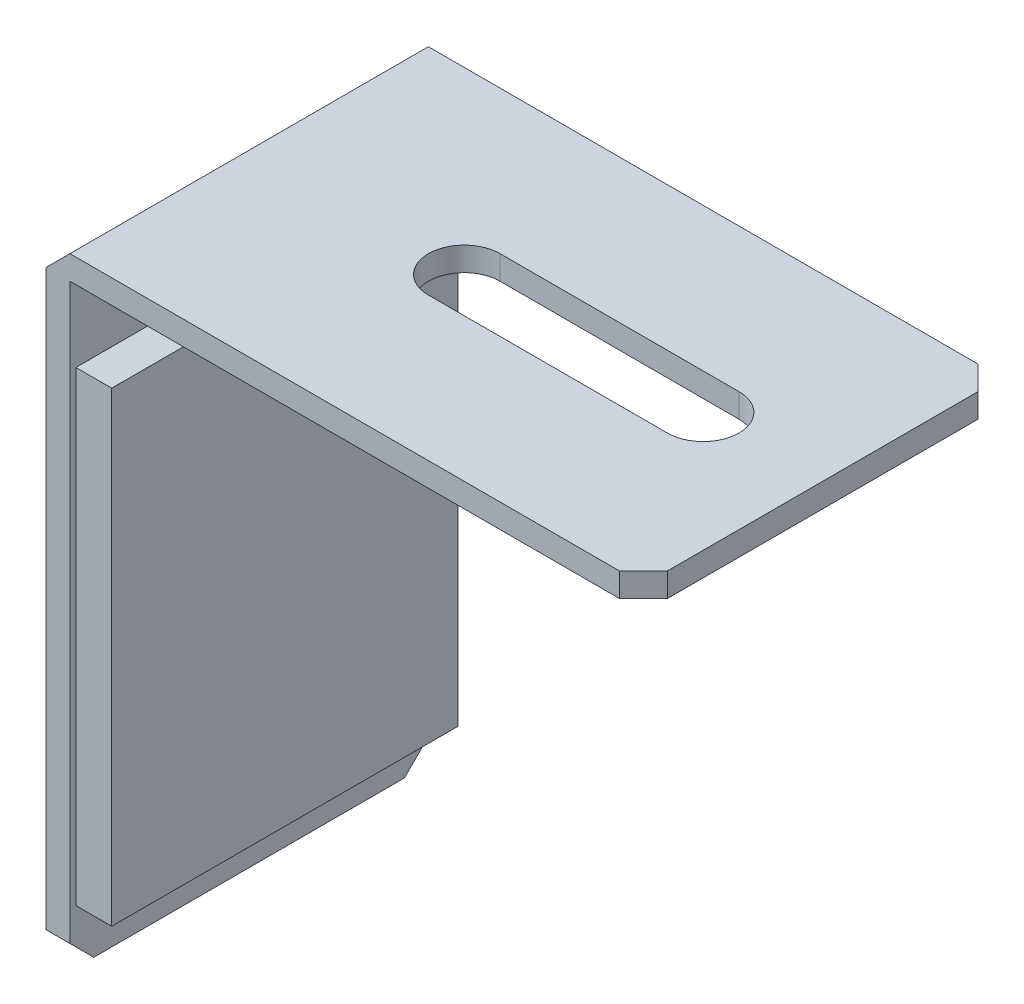
ISO-10303-21;
HEADER;
FILE_DESCRIPTION(('STEP AP214'),'2;1');
FILE_NAME('part.step','',(''),(''),'','','');
FILE_SCHEMA(('AUTOMOTIVE_DESIGN { 1 0 10303 214 1 1 1 1 }'));
ENDSEC;
DATA;
#1=APPLICATION_CONTEXT('core data for automotive mechanical design processes');
#2=APPLICATION_PROTOCOL_DEFINITION('international standard','automotive_design',2000,#1);
#3=PRODUCT_CONTEXT('',#1,'mechanical');
#4=PRODUCT('Part','Part','',(#3));
#5=PRODUCT_RELATED_PRODUCT_CATEGORY('part','',(#4));
#6=PRODUCT_DEFINITION_FORMATION('','',#4);
#7=PRODUCT_DEFINITION_CONTEXT('part definition',#1,'design');
#8=PRODUCT_DEFINITION('design','',#6,#7);
#9=PRODUCT_DEFINITION_SHAPE('','',#8);
#10=(LENGTH_UNIT() NAMED_UNIT(*) SI_UNIT(.MILLI.,.METRE.));
#11=(NAMED_UNIT(*) PLANE_ANGLE_UNIT() SI_UNIT($,.RADIAN.));
#12=(NAMED_UNIT(*) SI_UNIT($,.STERADIAN.) SOLID_ANGLE_UNIT());
#13=UNCERTAINTY_MEASURE_WITH_UNIT(LENGTH_MEASURE(1.E-05),#10,'distance_accuracy_value','');
#14=(GEOMETRIC_REPRESENTATION_CONTEXT(3) GLOBAL_UNCERTAINTY_ASSIGNED_CONTEXT((#13)) GLOBAL_UNIT_ASSIGNED_CONTEXT((#10,
#11,#12)) REPRESENTATION_CONTEXT('',''));
#15=CARTESIAN_POINT('',(0.,0.,0.));
#16=DIRECTION('',(0.,0.,1.));
#17=DIRECTION('',(1.,0.,0.));
#18=AXIS2_PLACEMENT_3D('',#15,#16,#17);
#19=CARTESIAN_POINT('',(2.,0.,30.));
#20=DIRECTION('',(-1.,0.,0.));
#21=DIRECTION('',(0.,0.,1.));
#22=AXIS2_PLACEMENT_3D('',#19,#20,#21);
#23=PLANE('',#22);
#24=DIRECTION('',(0.,0.,-1.));
#25=VECTOR('',#24,1.);
#26=CARTESIAN_POINT('',(2.,4.5,29.5));
#27=LINE('',#26,#25);
#28=CARTESIAN_POINT('',(2.,4.5,29.5));
#29=VERTEX_POINT('',#28);
#30=CARTESIAN_POINT('',(2.,4.5,0.5));
#31=VERTEX_POINT('',#30);
#32=EDGE_CURVE('E193',#29,#31,#27,.T.);
#33=ORIENTED_EDGE('',*,*,#32,.F.);
#34=DIRECTION('',(0.,1.,0.));
#35=VECTOR('',#34,1.);
#36=CARTESIAN_POINT('',(2.,4.5,29.5));
#37=LINE('',#36,#35);
#38=CARTESIAN_POINT('',(2.,43.5,29.5));
#39=VERTEX_POINT('',#38);
#40=EDGE_CURVE('E199',#29,#39,#37,.T.);
#41=ORIENTED_EDGE('',*,*,#40,.T.);
#42=DIRECTION('',(0.,0.,-1.));
#43=VECTOR('',#42,1.);
#44=CARTESIAN_POINT('',(2.,43.5,29.5));
#45=LINE('',#44,#43);
#46=CARTESIAN_POINT('',(2.,43.5,0.5));
#47=VERTEX_POINT('',#46);
#48=EDGE_CURVE('E175',#39,#47,#45,.T.);
#49=ORIENTED_EDGE('',*,*,#48,.T.);
#50=DIRECTION('',(0.,1.,0.));
#51=VECTOR('',#50,1.);
#52=CARTESIAN_POINT('',(2.,4.5,0.5));
#53=LINE('',#52,#51);
#54=EDGE_CURVE('E53',#31,#47,#53,.T.);
#55=ORIENTED_EDGE('',*,*,#54,.F.);
#56=EDGE_LOOP('',(#33,#41,#49,#55));
#57=FACE_BOUND('',#56,.T.);
#58=DIRECTION('',(0.,0.,-1.));
#59=VECTOR('',#58,1.);
#60=CARTESIAN_POINT('',(2.,0.,30.));
#61=LINE('',#60,#59);
#62=CARTESIAN_POINT('',(2.,0.,28.));
#63=VERTEX_POINT('',#62);
#64=CARTESIAN_POINT('',(2.,0.,2.00000000000001));
#65=VERTEX_POINT('',#64);
#66=EDGE_CURVE('E249',#63,#65,#61,.T.);
#67=ORIENTED_EDGE('',*,*,#66,.T.);
#68=DIRECTION('',(0.,-0.707106781186549,0.707106781186546));
#69=VECTOR('',#68,1.);
#70=CARTESIAN_POINT('',(2.,0.,2.00000000000001));
#71=LINE('',#70,#69);
#72=CARTESIAN_POINT('',(2.,2.00000000000002,0.));
#73=VERTEX_POINT('',#72);
#74=EDGE_CURVE('E307',#65,#73,#71,.F.);
#75=ORIENTED_EDGE('',*,*,#74,.T.);
#76=DIRECTION('',(0.,1.,0.));
#77=VECTOR('',#76,1.);
#78=CARTESIAN_POINT('',(2.,0.,0.));
#79=LINE('',#78,#77);
#80=CARTESIAN_POINT('',(2.,50.,0.));
#81=VERTEX_POINT('',#80);
#82=EDGE_CURVE('E236',#73,#81,#79,.T.);
#83=ORIENTED_EDGE('',*,*,#82,.T.);
#84=DIRECTION('',(0.,0.,-1.));
#85=VECTOR('',#84,1.);
#86=CARTESIAN_POINT('',(2.,50.,30.));
#87=LINE('',#86,#85);
#88=CARTESIAN_POINT('',(2.,50.,30.));
#89=VERTEX_POINT('',#88);
#90=EDGE_CURVE('E270',#89,#81,#87,.T.);
#91=ORIENTED_EDGE('',*,*,#90,.F.);
#92=DIRECTION('',(0.,1.,0.));
#93=VECTOR('',#92,1.);
#94=CARTESIAN_POINT('',(2.,0.,30.));
#95=LINE('',#94,#93);
#96=CARTESIAN_POINT('',(2.,2.00000000000001,30.));
#97=VERTEX_POINT('',#96);
#98=EDGE_CURVE('E237',#97,#89,#95,.T.);
#99=ORIENTED_EDGE('',*,*,#98,.F.);
#100=DIRECTION('',(0.,-0.707106781186546,-0.707106781186549));
#101=VECTOR('',#100,1.);
#102=CARTESIAN_POINT('',(2.,2.00000000000001,30.));
#103=LINE('',#102,#101);
#104=EDGE_CURVE('E305',#97,#63,#103,.T.);
#105=ORIENTED_EDGE('',*,*,#104,.T.);
#106=EDGE_LOOP('',(#67,#75,#83,#91,#99,#105));
#107=FACE_BOUND('',#106,.T.);
#108=ADVANCED_FACE('F38',(#57,#107),#23,.F.);
#109=CARTESIAN_POINT('',(0.,50.,30.));
#110=DIRECTION('',(0.,1.,0.));
#111=DIRECTION('',(0.,0.,1.));
#112=AXIS2_PLACEMENT_3D('',#109,#110,#111);
#113=PLANE('',#112);
#114=DIRECTION('',(1.,0.,0.));
#115=VECTOR('',#114,1.);
#116=CARTESIAN_POINT('',(0.,50.,12.));
#117=LINE('',#116,#115);
#118=CARTESIAN_POINT('',(20.,50.,12.));
#119=VERTEX_POINT('',#118);
#120=CARTESIAN_POINT('',(40.,50.,12.));
#121=VERTEX_POINT('',#120);
#122=EDGE_CURVE('E231',#119,#121,#117,.T.);
#123=ORIENTED_EDGE('',*,*,#122,.F.);
#124=CARTESIAN_POINT('',(20.,50.,15.));
#125=DIRECTION('',(0.,1.,0.));
#126=DIRECTION('',(0.,0.,1.));
#127=AXIS2_PLACEMENT_3D('',#124,#125,#126);
#128=CIRCLE('',#127,3.);
#129=CARTESIAN_POINT('',(20.,50.,18.));
#130=VERTEX_POINT('',#129);
#131=EDGE_CURVE('E233',#119,#130,#128,.T.);
#132=ORIENTED_EDGE('',*,*,#131,.T.);
#133=DIRECTION('',(1.,0.,0.));
#134=VECTOR('',#133,1.);
#135=CARTESIAN_POINT('',(0.,50.,18.));
#136=LINE('',#135,#134);
#137=CARTESIAN_POINT('',(40.,50.,18.));
#138=VERTEX_POINT('',#137);
#139=EDGE_CURVE('E220',#130,#138,#136,.T.);
#140=ORIENTED_EDGE('',*,*,#139,.T.);
#141=CARTESIAN_POINT('',(40.,50.,15.));
#142=DIRECTION('',(0.,1.,0.));
#143=DIRECTION('',(0.,0.,1.));
#144=AXIS2_PLACEMENT_3D('',#141,#142,#143);
#145=CIRCLE('',#144,3.);
#146=EDGE_CURVE('E228',#138,#121,#145,.T.);
#147=ORIENTED_EDGE('',*,*,#146,.T.);
#148=EDGE_LOOP('',(#123,#132,#140,#147));
#149=FACE_BOUND('',#148,.T.);
#150=DIRECTION('',(1.,0.,0.));
#151=VECTOR('',#150,1.);
#152=CARTESIAN_POINT('',(0.,50.,0.));
#153=LINE('',#152,#151);
#154=CARTESIAN_POINT('',(48.,50.,0.));
#155=VERTEX_POINT('',#154);
#156=EDGE_CURVE('E251',#81,#155,#153,.T.);
#157=ORIENTED_EDGE('',*,*,#156,.T.);
#158=DIRECTION('',(-0.707106781186549,0.,-0.707106781186546));
#159=VECTOR('',#158,1.);
#160=CARTESIAN_POINT('',(50.,50.,2.00000000000001));
#161=LINE('',#160,#159);
#162=CARTESIAN_POINT('',(50.,50.,2.00000000000001));
#163=VERTEX_POINT('',#162);
#164=EDGE_CURVE('E11',#155,#163,#161,.F.);
#165=ORIENTED_EDGE('',*,*,#164,.T.);
#166=DIRECTION('',(0.,0.,-1.));
#167=VECTOR('',#166,1.);
#168=CARTESIAN_POINT('',(50.,50.,30.));
#169=LINE('',#168,#167);
#170=CARTESIAN_POINT('',(50.,50.,28.));
#171=VERTEX_POINT('',#170);
#172=EDGE_CURVE('E267',#171,#163,#169,.T.);
#173=ORIENTED_EDGE('',*,*,#172,.F.);
#174=DIRECTION('',(-0.707106781186546,0.,0.707106781186549));
#175=VECTOR('',#174,1.);
#176=CARTESIAN_POINT('',(48.,50.,30.));
#177=LINE('',#176,#175);
#178=CARTESIAN_POINT('',(48.,50.,30.));
#179=VERTEX_POINT('',#178);
#180=EDGE_CURVE('E46',#171,#179,#177,.T.);
#181=ORIENTED_EDGE('',*,*,#180,.T.);
#182=DIRECTION('',(1.,0.,0.));
#183=VECTOR('',#182,1.);
#184=CARTESIAN_POINT('',(0.,50.,30.));
#185=LINE('',#184,#183);
#186=EDGE_CURVE('E239',#89,#179,#185,.T.);
#187=ORIENTED_EDGE('',*,*,#186,.F.);
#188=ORIENTED_EDGE('',*,*,#90,.T.);
#189=EDGE_LOOP('',(#157,#165,#173,#181,#187,#188));
#190=FACE_BOUND('',#189,.T.);
#191=ADVANCED_FACE('F317',(#149,#190),#113,.F.);
#192=CARTESIAN_POINT('',(50.,0.,30.));
#193=DIRECTION('',(-1.,0.,0.));
#194=DIRECTION('',(0.,0.,1.));
#195=AXIS2_PLACEMENT_3D('',#192,#193,#194);
#196=PLANE('',#195);
#197=ORIENTED_EDGE('',*,*,#172,.T.);
#198=DIRECTION('',(0.,1.,0.));
#199=VECTOR('',#198,1.);
#200=CARTESIAN_POINT('',(50.,0.,2.00000000000001));
#201=LINE('',#200,#199);
#202=CARTESIAN_POINT('',(50.,52.,2.00000000000001));
#203=VERTEX_POINT('',#202);
#204=EDGE_CURVE('E311',#163,#203,#201,.T.);
#205=ORIENTED_EDGE('',*,*,#204,.T.);
#206=DIRECTION('',(0.,0.,-1.));
#207=VECTOR('',#206,1.);
#208=CARTESIAN_POINT('',(50.,52.,30.));
#209=LINE('',#208,#207);
#210=CARTESIAN_POINT('',(50.,52.,28.));
#211=VERTEX_POINT('',#210);
#212=EDGE_CURVE('E264',#211,#203,#209,.T.);
#213=ORIENTED_EDGE('',*,*,#212,.F.);
#214=DIRECTION('',(0.,-1.,0.));
#215=VECTOR('',#214,1.);
#216=CARTESIAN_POINT('',(50.,50.,28.));
#217=LINE('',#216,#215);
#218=EDGE_CURVE('E309',#211,#171,#217,.T.);
#219=ORIENTED_EDGE('',*,*,#218,.T.);
#220=EDGE_LOOP('',(#197,#205,#213,#219));
#221=FACE_BOUND('',#220,.T.);
#222=ADVANCED_FACE('F331',(#221),#196,.F.);
#223=CARTESIAN_POINT('',(0.,52.,30.));
#224=DIRECTION('',(0.,1.,0.));
#225=DIRECTION('',(0.,0.,1.));
#226=AXIS2_PLACEMENT_3D('',#223,#224,#225);
#227=PLANE('',#226);
#228=CARTESIAN_POINT('',(20.,52.,15.));
#229=DIRECTION('',(0.,1.,0.));
#230=DIRECTION('',(0.,0.,1.));
#231=AXIS2_PLACEMENT_3D('',#228,#229,#230);
#232=CIRCLE('',#231,3.);
#233=CARTESIAN_POINT('',(20.,52.,12.));
#234=VERTEX_POINT('',#233);
#235=CARTESIAN_POINT('',(20.,52.,18.));
#236=VERTEX_POINT('',#235);
#237=EDGE_CURVE('E204',#234,#236,#232,.T.);
#238=ORIENTED_EDGE('',*,*,#237,.F.);
#239=DIRECTION('',(1.,0.,0.));
#240=VECTOR('',#239,1.);
#241=CARTESIAN_POINT('',(0.,52.,12.));
#242=LINE('',#241,#240);
#243=CARTESIAN_POINT('',(40.,52.,12.));
#244=VERTEX_POINT('',#243);
#245=EDGE_CURVE('E214',#234,#244,#242,.T.);
#246=ORIENTED_EDGE('',*,*,#245,.T.);
#247=CARTESIAN_POINT('',(40.,52.,15.));
#248=DIRECTION('',(0.,1.,0.));
#249=DIRECTION('',(0.,0.,1.));
#250=AXIS2_PLACEMENT_3D('',#247,#248,#249);
#251=CIRCLE('',#250,3.);
#252=CARTESIAN_POINT('',(40.,52.,18.));
#253=VERTEX_POINT('',#252);
#254=EDGE_CURVE('E211',#253,#244,#251,.T.);
#255=ORIENTED_EDGE('',*,*,#254,.F.);
#256=DIRECTION('',(1.,0.,0.));
#257=VECTOR('',#256,1.);
#258=CARTESIAN_POINT('',(0.,52.,18.));
#259=LINE('',#258,#257);
#260=EDGE_CURVE('E209',#236,#253,#259,.T.);
#261=ORIENTED_EDGE('',*,*,#260,.F.);
#262=EDGE_LOOP('',(#238,#246,#255,#261));
#263=FACE_BOUND('',#262,.T.);
#264=DIRECTION('',(1.,0.,0.));
#265=VECTOR('',#264,1.);
#266=CARTESIAN_POINT('',(0.,52.,0.));
#267=LINE('',#266,#265);
#268=CARTESIAN_POINT('',(2.00000000000001,52.,0.));
#269=VERTEX_POINT('',#268);
#270=CARTESIAN_POINT('',(48.,52.,0.));
#271=VERTEX_POINT('',#270);
#272=EDGE_CURVE('E254',#269,#271,#267,.T.);
#273=ORIENTED_EDGE('',*,*,#272,.F.);
#274=DIRECTION('',(0.,0.,1.));
#275=VECTOR('',#274,1.);
#276=CARTESIAN_POINT('',(2.00000000000001,52.,30.));
#277=LINE('',#276,#275);
#278=CARTESIAN_POINT('',(2.00000000000001,52.,30.));
#279=VERTEX_POINT('',#278);
#280=EDGE_CURVE('E290',#269,#279,#277,.T.);
#281=ORIENTED_EDGE('',*,*,#280,.T.);
#282=DIRECTION('',(1.,0.,0.));
#283=VECTOR('',#282,1.);
#284=CARTESIAN_POINT('',(0.,52.,30.));
#285=LINE('',#284,#283);
#286=CARTESIAN_POINT('',(48.,52.,30.));
#287=VERTEX_POINT('',#286);
#288=EDGE_CURVE('E243',#279,#287,#285,.T.);
#289=ORIENTED_EDGE('',*,*,#288,.T.);
#290=DIRECTION('',(0.707106781186546,0.,-0.707106781186549));
#291=VECTOR('',#290,1.);
#292=CARTESIAN_POINT('',(24.0000000000001,52.,54.));
#293=LINE('',#292,#291);
#294=EDGE_CURVE('E286',#287,#211,#293,.T.);
#295=ORIENTED_EDGE('',*,*,#294,.T.);
#296=ORIENTED_EDGE('',*,*,#212,.T.);
#297=DIRECTION('',(0.707106781186549,0.,0.707106781186546));
#298=VECTOR('',#297,1.);
#299=CARTESIAN_POINT('',(38.9999999999999,52.,-9.00000000000004));
#300=LINE('',#299,#298);
#301=EDGE_CURVE('E288',#203,#271,#300,.F.);
#302=ORIENTED_EDGE('',*,*,#301,.T.);
#303=EDGE_LOOP('',(#273,#281,#289,#295,#296,#302));
#304=FACE_BOUND('',#303,.T.);
#305=ADVANCED_FACE('F329',(#263,#304),#227,.T.);
#306=CARTESIAN_POINT('',(0.,0.,30.));
#307=DIRECTION('',(-1.,0.,0.));
#308=DIRECTION('',(0.,-1.,0.));
#309=AXIS2_PLACEMENT_3D('',#306,#307,#308);
#310=PLANE('',#309);
#311=DIRECTION('',(0.,1.,0.));
#312=VECTOR('',#311,1.);
#313=CARTESIAN_POINT('',(0.,0.,30.));
#314=LINE('',#313,#312);
#315=CARTESIAN_POINT('',(0.,2.00000000000001,30.));
#316=VERTEX_POINT('',#315);
#317=CARTESIAN_POINT('',(0.,50.,30.));
#318=VERTEX_POINT('',#317);
#319=EDGE_CURVE('E246',#316,#318,#314,.T.);
#320=ORIENTED_EDGE('',*,*,#319,.T.);
#321=DIRECTION('',(0.,0.,-1.));
#322=VECTOR('',#321,1.);
#323=CARTESIAN_POINT('',(0.,50.,30.));
#324=LINE('',#323,#322);
#325=CARTESIAN_POINT('',(0.,50.,0.));
#326=VERTEX_POINT('',#325);
#327=EDGE_CURVE('E277',#318,#326,#324,.T.);
#328=ORIENTED_EDGE('',*,*,#327,.T.);
#329=DIRECTION('',(0.,1.,0.));
#330=VECTOR('',#329,1.);
#331=CARTESIAN_POINT('',(0.,0.,0.));
#332=LINE('',#331,#330);
#333=CARTESIAN_POINT('',(0.,2.00000000000002,0.));
#334=VERTEX_POINT('',#333);
#335=EDGE_CURVE('E240',#334,#326,#332,.T.);
#336=ORIENTED_EDGE('',*,*,#335,.F.);
#337=DIRECTION('',(0.,0.707106781186549,-0.707106781186546));
#338=VECTOR('',#337,1.);
#339=CARTESIAN_POINT('',(0.,-14.,16.));
#340=LINE('',#339,#338);
#341=CARTESIAN_POINT('',(0.,0.,2.00000000000001));
#342=VERTEX_POINT('',#341);
#343=EDGE_CURVE('E275',#334,#342,#340,.F.);
#344=ORIENTED_EDGE('',*,*,#343,.T.);
#345=DIRECTION('',(0.,0.,-1.));
#346=VECTOR('',#345,1.);
#347=CARTESIAN_POINT('',(0.,0.,30.));
#348=LINE('',#347,#346);
#349=CARTESIAN_POINT('',(0.,0.,28.));
#350=VERTEX_POINT('',#349);
#351=EDGE_CURVE('E261',#350,#342,#348,.T.);
#352=ORIENTED_EDGE('',*,*,#351,.F.);
#353=DIRECTION('',(0.,0.707106781186546,0.707106781186549));
#354=VECTOR('',#353,1.);
#355=CARTESIAN_POINT('',(0.,1.00000000000001,29.));
#356=LINE('',#355,#354);
#357=EDGE_CURVE('E273',#350,#316,#356,.T.);
#358=ORIENTED_EDGE('',*,*,#357,.T.);
#359=EDGE_LOOP('',(#320,#328,#336,#344,#352,#358));
#360=FACE_BOUND('',#359,.T.);
#361=ADVANCED_FACE('F347',(#360),#310,.T.);
#362=CARTESIAN_POINT('',(0.,0.,30.));
#363=DIRECTION('',(0.,1.,0.));
#364=DIRECTION('',(0.,0.,1.));
#365=AXIS2_PLACEMENT_3D('',#362,#363,#364);
#366=PLANE('',#365);
#367=ORIENTED_EDGE('',*,*,#351,.T.);
#368=DIRECTION('',(1.,0.,0.));
#369=VECTOR('',#368,1.);
#370=CARTESIAN_POINT('',(0.,0.,2.00000000000001));
#371=LINE('',#370,#369);
#372=EDGE_CURVE('E302',#342,#65,#371,.T.);
#373=ORIENTED_EDGE('',*,*,#372,.T.);
#374=ORIENTED_EDGE('',*,*,#66,.F.);
#375=DIRECTION('',(-1.,0.,0.));
#376=VECTOR('',#375,1.);
#377=CARTESIAN_POINT('',(0.,0.,28.));
#378=LINE('',#377,#376);
#379=EDGE_CURVE('E300',#63,#350,#378,.T.);
#380=ORIENTED_EDGE('',*,*,#379,.T.);
#381=EDGE_LOOP('',(#367,#373,#374,#380));
#382=FACE_BOUND('',#381,.T.);
#383=ADVANCED_FACE('F359',(#382),#366,.F.);
#384=CARTESIAN_POINT('',(0.,0.,30.));
#385=DIRECTION('',(0.,0.,1.));
#386=DIRECTION('',(1.,0.,0.));
#387=AXIS2_PLACEMENT_3D('',#384,#385,#386);
#388=PLANE('',#387);
#389=ORIENTED_EDGE('',*,*,#288,.F.);
#390=DIRECTION('',(0.707106781186549,0.707106781186546,0.));
#391=VECTOR('',#390,1.);
#392=CARTESIAN_POINT('',(-25.,25.0000000000001,30.));
#393=LINE('',#392,#391);
#394=EDGE_CURVE('E298',#279,#318,#393,.F.);
#395=ORIENTED_EDGE('',*,*,#394,.T.);
#396=ORIENTED_EDGE('',*,*,#319,.F.);
#397=DIRECTION('',(1.,0.,0.));
#398=VECTOR('',#397,1.);
#399=CARTESIAN_POINT('',(2.,2.00000000000001,30.));
#400=LINE('',#399,#398);
#401=EDGE_CURVE('E295',#316,#97,#400,.T.);
#402=ORIENTED_EDGE('',*,*,#401,.T.);
#403=ORIENTED_EDGE('',*,*,#98,.T.);
#404=ORIENTED_EDGE('',*,*,#186,.T.);
#405=DIRECTION('',(0.,1.,0.));
#406=VECTOR('',#405,1.);
#407=CARTESIAN_POINT('',(48.,52.,30.));
#408=LINE('',#407,#406);
#409=EDGE_CURVE('E292',#179,#287,#408,.T.);
#410=ORIENTED_EDGE('',*,*,#409,.T.);
#411=EDGE_LOOP('',(#389,#395,#396,#402,#403,#404,#410));
#412=FACE_BOUND('',#411,.T.);
#413=ADVANCED_FACE('F324',(#412),#388,.T.);
#414=CARTESIAN_POINT('',(0.,0.,0.));
#415=DIRECTION('',(0.,0.,1.));
#416=DIRECTION('',(1.,0.,0.));
#417=AXIS2_PLACEMENT_3D('',#414,#415,#416);
#418=PLANE('',#417);
#419=ORIENTED_EDGE('',*,*,#335,.T.);
#420=DIRECTION('',(-0.707106781186549,-0.707106781186546,0.));
#421=VECTOR('',#420,1.);
#422=CARTESIAN_POINT('',(0.,50.,0.));
#423=LINE('',#422,#421);
#424=EDGE_CURVE('E284',#326,#269,#423,.F.);
#425=ORIENTED_EDGE('',*,*,#424,.T.);
#426=ORIENTED_EDGE('',*,*,#272,.T.);
#427=DIRECTION('',(0.,-1.,0.));
#428=VECTOR('',#427,1.);
#429=CARTESIAN_POINT('',(48.,0.,0.));
#430=LINE('',#429,#428);
#431=EDGE_CURVE('E280',#271,#155,#430,.T.);
#432=ORIENTED_EDGE('',*,*,#431,.T.);
#433=ORIENTED_EDGE('',*,*,#156,.F.);
#434=ORIENTED_EDGE('',*,*,#82,.F.);
#435=DIRECTION('',(-1.,0.,0.));
#436=VECTOR('',#435,1.);
#437=CARTESIAN_POINT('',(0.,2.00000000000002,0.));
#438=LINE('',#437,#436);
#439=EDGE_CURVE('E282',#73,#334,#438,.T.);
#440=ORIENTED_EDGE('',*,*,#439,.T.);
#441=EDGE_LOOP('',(#419,#425,#426,#432,#433,#434,#440));
#442=FACE_BOUND('',#441,.T.);
#443=ADVANCED_FACE('F339',(#442),#418,.F.);
#444=CARTESIAN_POINT('',(0.,50.,30.));
#445=DIRECTION('',(0.707106781186546,-0.707106781186549,0.));
#446=DIRECTION('',(0.,0.,-1.));
#447=AXIS2_PLACEMENT_3D('',#444,#445,#446);
#448=PLANE('',#447);
#449=ORIENTED_EDGE('',*,*,#394,.F.);
#450=ORIENTED_EDGE('',*,*,#280,.F.);
#451=ORIENTED_EDGE('',*,*,#424,.F.);
#452=ORIENTED_EDGE('',*,*,#327,.F.);
#453=EDGE_LOOP('',(#449,#450,#451,#452));
#454=FACE_BOUND('',#453,.T.);
#455=ADVANCED_FACE('F345',(#454),#448,.F.);
#456=CARTESIAN_POINT('',(0.,0.,2.00000000000001));
#457=DIRECTION('',(0.,0.707106781186546,0.707106781186549));
#458=DIRECTION('',(1.,0.,0.));
#459=AXIS2_PLACEMENT_3D('',#456,#457,#458);
#460=PLANE('',#459);
#461=ORIENTED_EDGE('',*,*,#343,.F.);
#462=ORIENTED_EDGE('',*,*,#439,.F.);
#463=ORIENTED_EDGE('',*,*,#74,.F.);
#464=ORIENTED_EDGE('',*,*,#372,.F.);
#465=EDGE_LOOP('',(#461,#462,#463,#464));
#466=FACE_BOUND('',#465,.T.);
#467=ADVANCED_FACE('F362',(#466),#460,.F.);
#468=CARTESIAN_POINT('',(0.,2.00000000000001,30.));
#469=DIRECTION('',(0.,-0.707106781186549,0.707106781186546));
#470=DIRECTION('',(-1.,0.,0.));
#471=AXIS2_PLACEMENT_3D('',#468,#469,#470);
#472=PLANE('',#471);
#473=ORIENTED_EDGE('',*,*,#357,.F.);
#474=ORIENTED_EDGE('',*,*,#379,.F.);
#475=ORIENTED_EDGE('',*,*,#104,.F.);
#476=ORIENTED_EDGE('',*,*,#401,.F.);
#477=EDGE_LOOP('',(#473,#474,#475,#476));
#478=FACE_BOUND('',#477,.T.);
#479=ADVANCED_FACE('F354',(#478),#472,.T.);
#480=CARTESIAN_POINT('',(50.,0.,2.00000000000001));
#481=DIRECTION('',(-0.707106781186546,0.,0.707106781186549));
#482=DIRECTION('',(0.,1.,0.));
#483=AXIS2_PLACEMENT_3D('',#480,#481,#482);
#484=PLANE('',#483);
#485=ORIENTED_EDGE('',*,*,#164,.F.);
#486=ORIENTED_EDGE('',*,*,#431,.F.);
#487=ORIENTED_EDGE('',*,*,#301,.F.);
#488=ORIENTED_EDGE('',*,*,#204,.F.);
#489=EDGE_LOOP('',(#485,#486,#487,#488));
#490=FACE_BOUND('',#489,.T.);
#491=ADVANCED_FACE('F335',(#490),#484,.F.);
#492=CARTESIAN_POINT('',(48.,0.,30.));
#493=DIRECTION('',(0.707106781186549,0.,0.707106781186546));
#494=DIRECTION('',(0.,-1.,0.));
#495=AXIS2_PLACEMENT_3D('',#492,#493,#494);
#496=PLANE('',#495);
#497=ORIENTED_EDGE('',*,*,#180,.F.);
#498=ORIENTED_EDGE('',*,*,#218,.F.);
#499=ORIENTED_EDGE('',*,*,#294,.F.);
#500=ORIENTED_EDGE('',*,*,#409,.F.);
#501=EDGE_LOOP('',(#497,#498,#499,#500));
#502=FACE_BOUND('',#501,.T.);
#503=ADVANCED_FACE('F40',(#502),#496,.T.);
#504=CARTESIAN_POINT('',(20.,37.,15.));
#505=DIRECTION('',(0.,1.,0.));
#506=DIRECTION('',(0.,0.,1.));
#507=AXIS2_PLACEMENT_3D('',#504,#505,#506);
#508=CYLINDRICAL_SURFACE('',#507,3.);
#509=DIRECTION('',(0.,1.,0.));
#510=VECTOR('',#509,1.);
#511=CARTESIAN_POINT('',(20.,37.,12.));
#512=LINE('',#511,#510);
#513=EDGE_CURVE('E218',#119,#234,#512,.T.);
#514=ORIENTED_EDGE('',*,*,#513,.T.);
#515=ORIENTED_EDGE('',*,*,#237,.T.);
#516=DIRECTION('',(0.,1.,0.));
#517=VECTOR('',#516,1.);
#518=CARTESIAN_POINT('',(20.,37.,18.));
#519=LINE('',#518,#517);
#520=EDGE_CURVE('E217',#130,#236,#519,.T.);
#521=ORIENTED_EDGE('',*,*,#520,.F.);
#522=ORIENTED_EDGE('',*,*,#131,.F.);
#523=EDGE_LOOP('',(#514,#515,#521,#522));
#524=FACE_BOUND('',#523,.T.);
#525=ADVANCED_FACE('F396',(#524),#508,.F.);
#526=CARTESIAN_POINT('',(0.,37.,12.));
#527=DIRECTION('',(0.,0.,1.));
#528=DIRECTION('',(1.,0.,0.));
#529=AXIS2_PLACEMENT_3D('',#526,#527,#528);
#530=PLANE('',#529);
#531=ORIENTED_EDGE('',*,*,#122,.T.);
#532=DIRECTION('',(0.,1.,0.));
#533=VECTOR('',#532,1.);
#534=CARTESIAN_POINT('',(40.,37.,12.));
#535=LINE('',#534,#533);
#536=EDGE_CURVE('E221',#121,#244,#535,.T.);
#537=ORIENTED_EDGE('',*,*,#536,.T.);
#538=ORIENTED_EDGE('',*,*,#245,.F.);
#539=ORIENTED_EDGE('',*,*,#513,.F.);
#540=EDGE_LOOP('',(#531,#537,#538,#539));
#541=FACE_BOUND('',#540,.T.);
#542=ADVANCED_FACE('F399',(#541),#530,.T.);
#543=CARTESIAN_POINT('',(40.,37.,15.));
#544=DIRECTION('',(0.,1.,0.));
#545=DIRECTION('',(0.,0.,1.));
#546=AXIS2_PLACEMENT_3D('',#543,#544,#545);
#547=CYLINDRICAL_SURFACE('',#546,3.);
#548=DIRECTION('',(0.,1.,0.));
#549=VECTOR('',#548,1.);
#550=CARTESIAN_POINT('',(40.,37.,18.));
#551=LINE('',#550,#549);
#552=EDGE_CURVE('E61',#138,#253,#551,.T.);
#553=ORIENTED_EDGE('',*,*,#552,.T.);
#554=ORIENTED_EDGE('',*,*,#254,.T.);
#555=ORIENTED_EDGE('',*,*,#536,.F.);
#556=ORIENTED_EDGE('',*,*,#146,.F.);
#557=EDGE_LOOP('',(#553,#554,#555,#556));
#558=FACE_BOUND('',#557,.T.);
#559=ADVANCED_FACE('F404',(#558),#547,.F.);
#560=CARTESIAN_POINT('',(0.,37.,18.));
#561=DIRECTION('',(0.,0.,1.));
#562=DIRECTION('',(1.,0.,0.));
#563=AXIS2_PLACEMENT_3D('',#560,#561,#562);
#564=PLANE('',#563);
#565=ORIENTED_EDGE('',*,*,#520,.T.);
#566=ORIENTED_EDGE('',*,*,#260,.T.);
#567=ORIENTED_EDGE('',*,*,#552,.F.);
#568=ORIENTED_EDGE('',*,*,#139,.F.);
#569=EDGE_LOOP('',(#565,#566,#567,#568));
#570=FACE_BOUND('',#569,.T.);
#571=ADVANCED_FACE('F401',(#570),#564,.F.);
#572=CARTESIAN_POINT('',(5.,4.5,29.5));
#573=DIRECTION('',(0.,0.,1.));
#574=DIRECTION('',(1.,0.,0.));
#575=AXIS2_PLACEMENT_3D('',#572,#573,#574);
#576=PLANE('',#575);
#577=ORIENTED_EDGE('',*,*,#40,.F.);
#578=DIRECTION('',(-1.,0.,0.));
#579=VECTOR('',#578,1.);
#580=CARTESIAN_POINT('',(5.,4.5,29.5));
#581=LINE('',#580,#579);
#582=CARTESIAN_POINT('',(5.,4.5,29.5));
#583=VERTEX_POINT('',#582);
#584=EDGE_CURVE('E191',#583,#29,#581,.T.);
#585=ORIENTED_EDGE('',*,*,#584,.F.);
#586=DIRECTION('',(0.,1.,0.));
#587=VECTOR('',#586,1.);
#588=CARTESIAN_POINT('',(5.,4.5,29.5));
#589=LINE('',#588,#587);
#590=CARTESIAN_POINT('',(5.,43.5,29.5));
#591=VERTEX_POINT('',#590);
#592=EDGE_CURVE('E186',#583,#591,#589,.T.);
#593=ORIENTED_EDGE('',*,*,#592,.T.);
#594=DIRECTION('',(-1.,0.,0.));
#595=VECTOR('',#594,1.);
#596=CARTESIAN_POINT('',(5.,43.5,29.5));
#597=LINE('',#596,#595);
#598=EDGE_CURVE('E170',#591,#39,#597,.T.);
#599=ORIENTED_EDGE('',*,*,#598,.T.);
#600=EDGE_LOOP('',(#577,#585,#593,#599));
#601=FACE_BOUND('',#600,.T.);
#602=ADVANCED_FACE('F190',(#601),#576,.T.);
#603=CARTESIAN_POINT('',(5.,4.5,29.5));
#604=DIRECTION('',(0.,1.,0.));
#605=DIRECTION('',(0.,0.,1.));
#606=AXIS2_PLACEMENT_3D('',#603,#604,#605);
#607=PLANE('',#606);
#608=ORIENTED_EDGE('',*,*,#32,.T.);
#609=DIRECTION('',(-1.,0.,0.));
#610=VECTOR('',#609,1.);
#611=CARTESIAN_POINT('',(5.,4.5,0.5));
#612=LINE('',#611,#610);
#613=CARTESIAN_POINT('',(5.,4.5,0.5));
#614=VERTEX_POINT('',#613);
#615=EDGE_CURVE('E205',#614,#31,#612,.T.);
#616=ORIENTED_EDGE('',*,*,#615,.F.);
#617=DIRECTION('',(0.,0.,-1.));
#618=VECTOR('',#617,1.);
#619=CARTESIAN_POINT('',(5.,4.5,29.5));
#620=LINE('',#619,#618);
#621=EDGE_CURVE('E181',#583,#614,#620,.T.);
#622=ORIENTED_EDGE('',*,*,#621,.F.);
#623=ORIENTED_EDGE('',*,*,#584,.T.);
#624=EDGE_LOOP('',(#608,#616,#622,#623));
#625=FACE_BOUND('',#624,.T.);
#626=ADVANCED_FACE('F413',(#625),#607,.F.);
#627=CARTESIAN_POINT('',(5.,4.5,0.5));
#628=DIRECTION('',(0.,0.,1.));
#629=DIRECTION('',(0.,-1.,0.));
#630=AXIS2_PLACEMENT_3D('',#627,#628,#629);
#631=PLANE('',#630);
#632=ORIENTED_EDGE('',*,*,#54,.T.);
#633=DIRECTION('',(-1.,0.,0.));
#634=VECTOR('',#633,1.);
#635=CARTESIAN_POINT('',(5.,43.5,0.5));
#636=LINE('',#635,#634);
#637=CARTESIAN_POINT('',(5.,43.5,0.5));
#638=VERTEX_POINT('',#637);
#639=EDGE_CURVE('E180',#638,#47,#636,.T.);
#640=ORIENTED_EDGE('',*,*,#639,.F.);
#641=DIRECTION('',(0.,1.,0.));
#642=VECTOR('',#641,1.);
#643=CARTESIAN_POINT('',(5.,4.5,0.5));
#644=LINE('',#643,#642);
#645=EDGE_CURVE('E188',#614,#638,#644,.T.);
#646=ORIENTED_EDGE('',*,*,#645,.F.);
#647=ORIENTED_EDGE('',*,*,#615,.T.);
#648=EDGE_LOOP('',(#632,#640,#646,#647));
#649=FACE_BOUND('',#648,.T.);
#650=ADVANCED_FACE('F416',(#649),#631,.F.);
#651=CARTESIAN_POINT('',(5.,43.5,29.5));
#652=DIRECTION('',(0.,1.,0.));
#653=DIRECTION('',(0.,0.,1.));
#654=AXIS2_PLACEMENT_3D('',#651,#652,#653);
#655=PLANE('',#654);
#656=ORIENTED_EDGE('',*,*,#48,.F.);
#657=ORIENTED_EDGE('',*,*,#598,.F.);
#658=DIRECTION('',(0.,0.,-1.));
#659=VECTOR('',#658,1.);
#660=CARTESIAN_POINT('',(5.,43.5,29.5));
#661=LINE('',#660,#659);
#662=EDGE_CURVE('E173',#591,#638,#661,.T.);
#663=ORIENTED_EDGE('',*,*,#662,.T.);
#664=ORIENTED_EDGE('',*,*,#639,.T.);
#665=EDGE_LOOP('',(#656,#657,#663,#664));
#666=FACE_BOUND('',#665,.T.);
#667=ADVANCED_FACE('F172',(#666),#655,.T.);
#668=CARTESIAN_POINT('',(5.,0.,0.));
#669=DIRECTION('',(-1.,0.,0.));
#670=DIRECTION('',(0.,0.,1.));
#671=AXIS2_PLACEMENT_3D('',#668,#669,#670);
#672=PLANE('',#671);
#673=ORIENTED_EDGE('',*,*,#592,.F.);
#674=ORIENTED_EDGE('',*,*,#621,.T.);
#675=ORIENTED_EDGE('',*,*,#645,.T.);
#676=ORIENTED_EDGE('',*,*,#662,.F.);
#677=EDGE_LOOP('',(#673,#674,#675,#676));
#678=FACE_BOUND('',#677,.T.);
#679=ADVANCED_FACE('F185',(#678),#672,.F.);
#680=CLOSED_SHELL('',(#108,#191,#222,#305,#361,#383,#413,#443,#455,#467,#479,#491,#503,#525,
#542,#559,#571,#602,#626,#650,#667,#679));
#681=MANIFOLD_SOLID_BREP('B2',#680);
#682=ADVANCED_BREP_SHAPE_REPRESENTATION('',(#18,#681),#14);
#683=SHAPE_DEFINITION_REPRESENTATION(#9,#682);
ENDSEC;
END-ISO-10303-21;
